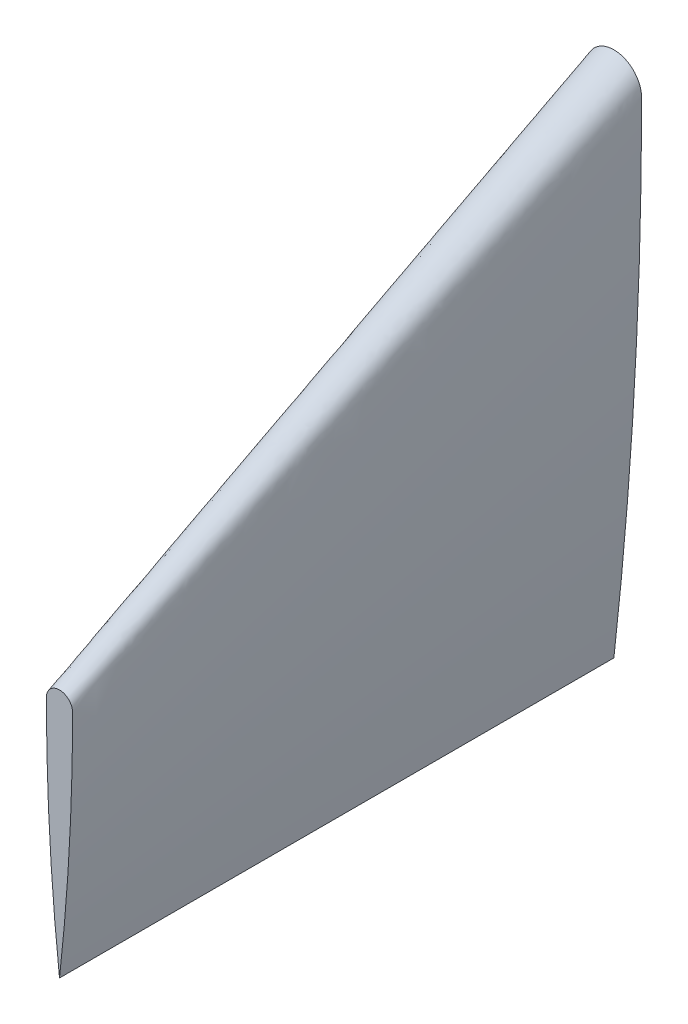
ISO-10303-21;
HEADER;
FILE_DESCRIPTION(('STEP AP214'),'2;1');
FILE_NAME('part.step','',(''),(''),'','','');
FILE_SCHEMA(('AUTOMOTIVE_DESIGN { 1 0 10303 214 1 1 1 1 }'));
ENDSEC;
DATA;
#1=APPLICATION_CONTEXT('core data for automotive mechanical design processes');
#2=APPLICATION_PROTOCOL_DEFINITION('international standard','automotive_design',2000,#1);
#3=PRODUCT_CONTEXT('',#1,'mechanical');
#4=PRODUCT('Part','Part','',(#3));
#5=PRODUCT_RELATED_PRODUCT_CATEGORY('part','',(#4));
#6=PRODUCT_DEFINITION_FORMATION('','',#4);
#7=PRODUCT_DEFINITION_CONTEXT('part definition',#1,'design');
#8=PRODUCT_DEFINITION('design','',#6,#7);
#9=PRODUCT_DEFINITION_SHAPE('','',#8);
#10=(LENGTH_UNIT() NAMED_UNIT(*) SI_UNIT(.MILLI.,.METRE.));
#11=(NAMED_UNIT(*) PLANE_ANGLE_UNIT() SI_UNIT($,.RADIAN.));
#12=(NAMED_UNIT(*) SI_UNIT($,.STERADIAN.) SOLID_ANGLE_UNIT());
#13=UNCERTAINTY_MEASURE_WITH_UNIT(LENGTH_MEASURE(1.E-05),#10,'distance_accuracy_value','');
#14=(GEOMETRIC_REPRESENTATION_CONTEXT(3) GLOBAL_UNCERTAINTY_ASSIGNED_CONTEXT((#13)) GLOBAL_UNIT_ASSIGNED_CONTEXT((#10,
#11,#12)) REPRESENTATION_CONTEXT('',''));
#15=CARTESIAN_POINT('',(0.,0.,0.));
#16=DIRECTION('',(0.,0.,1.));
#17=DIRECTION('',(1.,0.,0.));
#18=AXIS2_PLACEMENT_3D('',#15,#16,#17);
#19=CARTESIAN_POINT('',(573.749999999988,-142.105263157895,300.));
#20=DIRECTION('',(0.,0.,1.));
#21=DIRECTION('',(1.,0.,0.));
#22=AXIS2_PLACEMENT_3D('',#19,#20,#21);
#23=PLANE('',#22);
#24=CARTESIAN_POINT('',(0.,-142.105263157895,300.));
#25=DIRECTION('',(0.,0.,1.));
#26=DIRECTION('',(1.,0.,0.));
#27=AXIS2_PLACEMENT_3D('',#24,#25,#26);
#28=CIRCLE('',#27,7.10526315789473);
#29=CARTESIAN_POINT('',(7.10526315789473,-142.105263157896,300.));
#30=VERTEX_POINT('',#29);
#31=CARTESIAN_POINT('',(-7.10526315789473,-142.105263157895,300.));
#32=VERTEX_POINT('',#31);
#33=EDGE_CURVE('E223',#30,#32,#28,.T.);
#34=ORIENTED_EDGE('',*,*,#33,.T.);
#35=CARTESIAN_POINT('',(1147.49999999998,-142.105263157896,300.));
#36=DIRECTION('',(0.,0.,1.));
#37=DIRECTION('',(1.,0.,0.));
#38=AXIS2_PLACEMENT_3D('',#35,#36,#37);
#39=CIRCLE('',#38,1154.60526315787);
#40=CARTESIAN_POINT('',(0.,-270.,300.));
#41=VERTEX_POINT('',#40);
#42=EDGE_CURVE('E92',#32,#41,#39,.T.);
#43=ORIENTED_EDGE('',*,*,#42,.T.);
#44=CARTESIAN_POINT('',(-1147.49999999998,-142.105263157896,300.));
#45=DIRECTION('',(0.,0.,1.));
#46=DIRECTION('',(1.,0.,0.));
#47=AXIS2_PLACEMENT_3D('',#44,#45,#46);
#48=CIRCLE('',#47,1154.60526315787);
#49=EDGE_CURVE('E12',#41,#30,#48,.T.);
#50=ORIENTED_EDGE('',*,*,#49,.T.);
#51=EDGE_LOOP('',(#34,#43,#50));
#52=FACE_BOUND('',#51,.T.);
#53=ADVANCED_FACE('F82',(#52),#23,.T.);
#54=CARTESIAN_POINT('',(0.,-2.78943534937071E-12,0.));
#55=DIRECTION('',(0.,0.,1.));
#56=DIRECTION('',(1.,0.,0.));
#57=AXIS2_PLACEMENT_3D('',#54,#55,#56);
#58=PLANE('',#57);
#59=CARTESIAN_POINT('',(2422.49999999995,-2.78943534937071E-12,0.));
#60=DIRECTION('',(0.,0.,1.));
#61=DIRECTION('',(1.,0.,0.));
#62=AXIS2_PLACEMENT_3D('',#59,#60,#61);
#63=CIRCLE('',#62,2437.49999999995);
#64=CARTESIAN_POINT('',(-15.,0.,0.));
#65=VERTEX_POINT('',#64);
#66=CARTESIAN_POINT('',(0.,-269.999999999999,0.));
#67=VERTEX_POINT('',#66);
#68=EDGE_CURVE('E123',#65,#67,#63,.T.);
#69=ORIENTED_EDGE('',*,*,#68,.F.);
#70=CARTESIAN_POINT('',(0.,0.,0.));
#71=DIRECTION('',(0.,0.,1.));
#72=DIRECTION('',(-1.,0.,0.));
#73=AXIS2_PLACEMENT_3D('',#70,#71,#72);
#74=CIRCLE('',#73,15.);
#75=CARTESIAN_POINT('',(15.,0.,0.));
#76=VERTEX_POINT('',#75);
#77=EDGE_CURVE('E127',#76,#65,#74,.T.);
#78=ORIENTED_EDGE('',*,*,#77,.F.);
#79=CARTESIAN_POINT('',(-2422.49999999995,-2.78943534937071E-12,0.));
#80=DIRECTION('',(0.,0.,1.));
#81=DIRECTION('',(-1.,0.,0.));
#82=AXIS2_PLACEMENT_3D('',#79,#80,#81);
#83=CIRCLE('',#82,2437.49999999995);
#84=EDGE_CURVE('E132',#67,#76,#83,.T.);
#85=ORIENTED_EDGE('',*,*,#84,.F.);
#86=EDGE_LOOP('',(#69,#78,#85));
#87=FACE_BOUND('',#86,.T.);
#88=ADVANCED_FACE('F139',(#87),#58,.F.);
#89=CARTESIAN_POINT('',(-15.0000000000001,-3.25992794059533E-13,0.));
#90=CARTESIAN_POINT('',(-7.10526315789473,-142.105263157895,300.));
#91=CARTESIAN_POINT('',(-15.0000000000001,-90.2619654308953,0.));
#92=CARTESIAN_POINT('',(-7.10526315789473,-184.860930993582,300.));
#93=CARTESIAN_POINT('',(-9.99824847849951,-180.293492817909,0.));
#94=CARTESIAN_POINT('',(-4.7360124371838,-227.507443966378,300.));
#95=CARTESIAN_POINT('',(-4.44089209850063E-13,-269.999999999998,0.));
#96=CARTESIAN_POINT('',(0.,-270.,300.));
#97=B_SPLINE_SURFACE_WITH_KNOTS('',3,1,((#89,#90),(#91,#92),(#93,#94),(#95,#96)),.UNSPECIFIED.,
.F.,.F.,.F.,(4,4),(2,2),(0.,1.),(0.,1.),.UNSPECIFIED.);
#98=DIRECTION('',(0.,0.,1.));
#99=VECTOR('',#98,1.);
#100=CARTESIAN_POINT('',(-2.22044604925031E-13,-269.999999999999,150.));
#101=LINE('',#100,#99);
#102=EDGE_CURVE('E107',#67,#41,#101,.T.);
#103=DIRECTION('',(-0.0237758517182741,0.427965330928926,-0.903482365294401));
#104=VECTOR('',#103,1.);
#105=CARTESIAN_POINT('',(-11.0526315789474,-71.0526315789476,150.));
#106=LINE('',#105,#104);
#107=EDGE_CURVE('E119',#32,#65,#106,.T.);
#108=ORIENTED_EDGE('',*,*,#68,.T.);
#109=ORIENTED_EDGE('',*,*,#102,.T.);
#110=ORIENTED_EDGE('',*,*,#42,.F.);
#111=ORIENTED_EDGE('',*,*,#107,.T.);
#112=EDGE_LOOP('',(#108,#109,#110,#111));
#113=FACE_BOUND('',#112,.T.);
#114=ADVANCED_FACE('F121',(#113),#97,.T.);
#115=CARTESIAN_POINT('',(4.44089209850063E-13,-269.999999999999,0.));
#116=CARTESIAN_POINT('',(0.,-270.,300.));
#117=CARTESIAN_POINT('',(2.49743273586487,-247.592478508771,0.));
#118=CARTESIAN_POINT('',(1.18299445383053,-259.385910872576,300.));
#119=CARTESIAN_POINT('',(6.87047032599434,-202.708129778592,0.));
#120=CARTESIAN_POINT('',(3.25443331208197,-238.124903581399,300.));
#121=CARTESIAN_POINT('',(11.5594707949632,-135.225526155275,0.));
#122=CARTESIAN_POINT('',(5.47553879767154,-206.159459757766,299.999999999999));
#123=CARTESIAN_POINT('',(14.3743218071553,-67.6388031176934,0.));
#124=CARTESIAN_POINT('',(6.80888927707263,-174.144696211568,300.000000000001));
#125=CARTESIAN_POINT('',(15.0000000000001,-22.5462677543324,0.));
#126=CARTESIAN_POINT('',(7.10526315789473,-152.785074199422,300.));
#127=CARTESIAN_POINT('',(15.,1.96349539282515,0.));
#128=CARTESIAN_POINT('',(7.10526315789491,-141.175186392874,300.));
#129=CARTESIAN_POINT('',(14.219699453941,5.88974981965386,0.));
#130=CARTESIAN_POINT('',(6.73575013790164,-139.315420305796,299.999999999999));
#131=CARTESIAN_POINT('',(10.8830057840709,10.8831899638928,0.));
#132=CARTESIAN_POINT('',(5.15505941574248,-136.950038159963,300.000000000001));
#133=CARTESIAN_POINT('',(5.88994684071765,14.2194050561287,0.));
#134=CARTESIAN_POINT('',(2.78994502310814,-135.369775834833,300.));
#135=CARTESIAN_POINT('',(0.,15.3910879617177,0.));
#136=CARTESIAN_POINT('',(6.63531729561129E-13,-134.81472566601,300.));
#137=CARTESIAN_POINT('',(-5.88994684071763,14.2194050561287,0.));
#138=CARTESIAN_POINT('',(-2.78994502310693,-135.369775834832,300.));
#139=CARTESIAN_POINT('',(-10.883005784071,10.8831899638928,0.));
#140=CARTESIAN_POINT('',(-5.15505941574152,-136.950038159963,300.));
#141=CARTESIAN_POINT('',(-14.219699453941,5.88974981965388,0.));
#142=CARTESIAN_POINT('',(-6.73575013790115,-139.315420305795,300.));
#143=CARTESIAN_POINT('',(-15.,1.96349539282514,0.));
#144=CARTESIAN_POINT('',(-7.10526315789474,-141.175186392872,300.));
#145=CARTESIAN_POINT('',(-15.,0.,0.));
#146=CARTESIAN_POINT('',(-7.10526315789473,-142.105263157895,300.));
#147=B_SPLINE_SURFACE_WITH_KNOTS('',3,1,((#115,#116),(#117,#118),(#119,#120),(#121,#122),(#123,
#124),(#125,#126),(#127,#128),(#129,#130),(#131,#132),(#133,#134),(#135,#136),(#137,#138),(#139,
#140),(#141,#142),(#143,#144),(#145,#146)),.UNSPECIFIED.,.F.,.F.,.F.,(4,1,1,1,2,1,1,1,1,1,1,1,
4),(2,2),(0.,0.212915494458778,0.425830988917555,0.638746483376333,0.85166197783511,
0.870204230605721,0.888746483376333,0.907288736146944,0.925830988917555,0.944373241688166,
0.962915494458778,0.981457747229389,1.),(0.,1.),.UNSPECIFIED.);
#148=ORIENTED_EDGE('',*,*,#84,.T.);
#149=ORIENTED_EDGE('',*,*,#77,.T.);
#150=ORIENTED_EDGE('',*,*,#107,.F.);
#151=ORIENTED_EDGE('',*,*,#33,.F.);
#152=ORIENTED_EDGE('',*,*,#49,.F.);
#153=ORIENTED_EDGE('',*,*,#102,.F.);
#154=EDGE_LOOP('',(#148,#149,#150,#151,#152,#153));
#155=FACE_BOUND('',#154,.T.);
#156=ADVANCED_FACE('F131',(#155),#147,.T.);
#157=CLOSED_SHELL('',(#53,#88,#114,#156));
#158=MANIFOLD_SOLID_BREP('B2',#157);
#159=ADVANCED_BREP_SHAPE_REPRESENTATION('',(#18,#158),#14);
#160=SHAPE_DEFINITION_REPRESENTATION(#9,#159);
ENDSEC;
END-ISO-10303-21;
